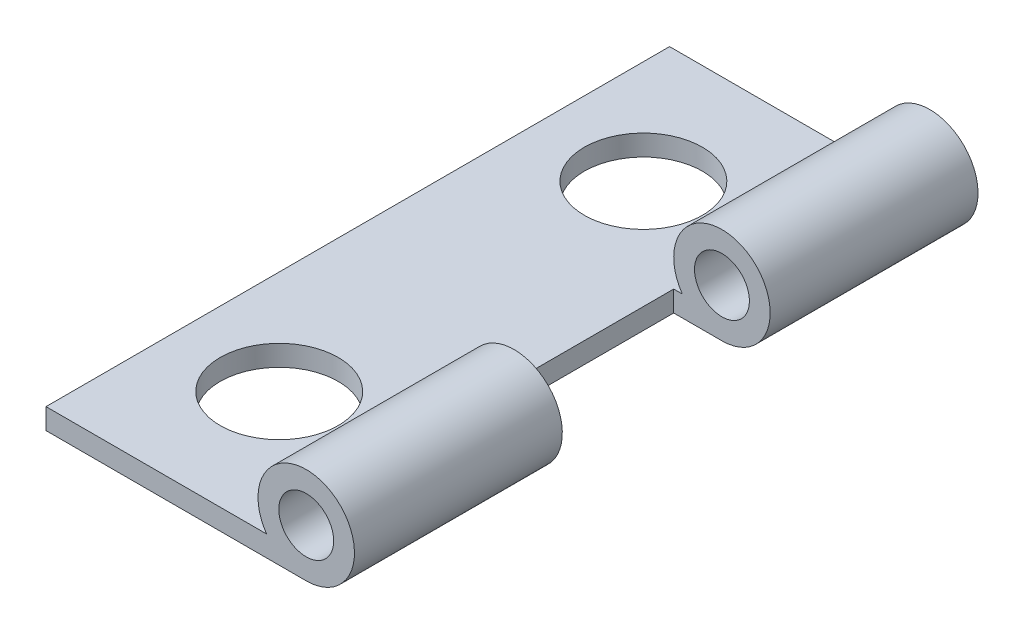
ISO-10303-21;
HEADER;
FILE_DESCRIPTION(('STEP AP214'),'2;1');
FILE_NAME('part.step','',(''),(''),'','','');
FILE_SCHEMA(('AUTOMOTIVE_DESIGN { 1 0 10303 214 1 1 1 1 }'));
ENDSEC;
DATA;
#1=APPLICATION_CONTEXT('core data for automotive mechanical design processes');
#2=APPLICATION_PROTOCOL_DEFINITION('international standard','automotive_design',2000,#1);
#3=PRODUCT_CONTEXT('',#1,'mechanical');
#4=PRODUCT('Part','Part','',(#3));
#5=PRODUCT_RELATED_PRODUCT_CATEGORY('part','',(#4));
#6=PRODUCT_DEFINITION_FORMATION('','',#4);
#7=PRODUCT_DEFINITION_CONTEXT('part definition',#1,'design');
#8=PRODUCT_DEFINITION('design','',#6,#7);
#9=PRODUCT_DEFINITION_SHAPE('','',#8);
#10=(LENGTH_UNIT() NAMED_UNIT(*) SI_UNIT(.MILLI.,.METRE.));
#11=(NAMED_UNIT(*) PLANE_ANGLE_UNIT() SI_UNIT($,.RADIAN.));
#12=(NAMED_UNIT(*) SI_UNIT($,.STERADIAN.) SOLID_ANGLE_UNIT());
#13=UNCERTAINTY_MEASURE_WITH_UNIT(LENGTH_MEASURE(1.E-05),#10,'distance_accuracy_value','');
#14=(GEOMETRIC_REPRESENTATION_CONTEXT(3) GLOBAL_UNCERTAINTY_ASSIGNED_CONTEXT((#13)) GLOBAL_UNIT_ASSIGNED_CONTEXT((#10,
#11,#12)) REPRESENTATION_CONTEXT('',''));
#15=CARTESIAN_POINT('',(0.,0.,0.));
#16=DIRECTION('',(0.,0.,1.));
#17=DIRECTION('',(1.,0.,0.));
#18=AXIS2_PLACEMENT_3D('',#15,#16,#17);
#19=CARTESIAN_POINT('',(-3.0846776,3.10992480641689,19.05));
#20=DIRECTION('',(0.,0.,-1.));
#21=DIRECTION('',(-1.,0.,0.));
#22=AXIS2_PLACEMENT_3D('',#19,#20,#21);
#23=CYLINDRICAL_SURFACE('',#22,1.4732);
#24=DIRECTION('',(0.,0.,-1.));
#25=VECTOR('',#24,1.);
#26=CARTESIAN_POINT('',(-4.29618038579952,2.27172480641689,19.05));
#27=LINE('',#26,#25);
#28=CARTESIAN_POINT('',(-4.29618038579952,2.27172480641689,6.35));
#29=VERTEX_POINT('',#28);
#30=CARTESIAN_POINT('',(-4.29618038579952,2.27172480641689,0.));
#31=VERTEX_POINT('',#30);
#32=EDGE_CURVE('E181',#29,#31,#27,.T.);
#33=ORIENTED_EDGE('',*,*,#32,.F.);
#34=CARTESIAN_POINT('',(-3.0846776,3.10992480641689,6.35));
#35=DIRECTION('',(0.,0.,-1.));
#36=DIRECTION('',(-1.,0.,0.));
#37=AXIS2_PLACEMENT_3D('',#34,#35,#36);
#38=CIRCLE('',#37,1.4732);
#39=CARTESIAN_POINT('',(-3.0846776,1.63672480641689,6.35));
#40=VERTEX_POINT('',#39);
#41=EDGE_CURVE('E142',#29,#40,#38,.T.);
#42=ORIENTED_EDGE('',*,*,#41,.T.);
#43=DIRECTION('',(0.,0.,-1.));
#44=VECTOR('',#43,1.);
#45=CARTESIAN_POINT('',(-3.0846776,1.63672480641689,19.05));
#46=LINE('',#45,#44);
#47=CARTESIAN_POINT('',(-3.0846776,1.63672480641689,0.));
#48=VERTEX_POINT('',#47);
#49=EDGE_CURVE('E185',#40,#48,#46,.T.);
#50=ORIENTED_EDGE('',*,*,#49,.T.);
#51=CARTESIAN_POINT('',(-3.0846776,3.10992480641689,0.));
#52=DIRECTION('',(0.,0.,1.));
#53=DIRECTION('',(1.,0.,0.));
#54=AXIS2_PLACEMENT_3D('',#51,#52,#53);
#55=CIRCLE('',#54,1.4732);
#56=EDGE_CURVE('E172',#48,#31,#55,.T.);
#57=ORIENTED_EDGE('',*,*,#56,.T.);
#58=EDGE_LOOP('',(#33,#42,#50,#57));
#59=FACE_BOUND('',#58,.T.);
#60=ADVANCED_FACE('F37',(#59),#23,.T.);
#61=CARTESIAN_POINT('',(-3.0846776,3.10992480641689,19.05));
#62=DIRECTION('',(0.,0.,-1.));
#63=DIRECTION('',(-1.,0.,0.));
#64=AXIS2_PLACEMENT_3D('',#61,#62,#63);
#65=CYLINDRICAL_SURFACE('',#64,0.8382);
#66=CARTESIAN_POINT('',(-3.0846776,3.10992480641689,6.35));
#67=DIRECTION('',(0.,0.,-1.));
#68=DIRECTION('',(-1.,0.,0.));
#69=AXIS2_PLACEMENT_3D('',#66,#67,#68);
#70=CIRCLE('',#69,0.8382);
#71=CARTESIAN_POINT('',(-3.9228776,3.10992480641689,6.35));
#72=VERTEX_POINT('',#71);
#73=EDGE_CURVE('E138',#72,#72,#70,.T.);
#74=ORIENTED_EDGE('',*,*,#73,.F.);
#75=EDGE_LOOP('',(#74));
#76=FACE_BOUND('',#75,.T.);
#77=CARTESIAN_POINT('',(-3.0846776,3.10992480641689,0.));
#78=DIRECTION('',(0.,0.,1.));
#79=DIRECTION('',(-1.,0.,0.));
#80=AXIS2_PLACEMENT_3D('',#77,#78,#79);
#81=CIRCLE('',#80,0.8382);
#82=CARTESIAN_POINT('',(-3.9228776,3.10992480641689,0.));
#83=VERTEX_POINT('',#82);
#84=EDGE_CURVE('E156',#83,#83,#81,.T.);
#85=ORIENTED_EDGE('',*,*,#84,.F.);
#86=EDGE_LOOP('',(#85));
#87=FACE_BOUND('',#86,.T.);
#88=ADVANCED_FACE('F194',(#76,#87),#65,.F.);
#89=CARTESIAN_POINT('',(-3.0846776,3.10992480641689,19.05));
#90=DIRECTION('',(0.,0.,1.));
#91=DIRECTION('',(1.,0.,0.));
#92=AXIS2_PLACEMENT_3D('',#89,#90,#91);
#93=PLANE('',#92);
#94=DIRECTION('',(1.,0.,0.));
#95=VECTOR('',#94,1.);
#96=CARTESIAN_POINT('',(-11.0348776,1.63672480641689,19.05));
#97=LINE('',#96,#95);
#98=CARTESIAN_POINT('',(-11.0348776,1.63672480641689,19.05));
#99=VERTEX_POINT('',#98);
#100=CARTESIAN_POINT('',(-3.0846776,1.63672480641689,19.05));
#101=VERTEX_POINT('',#100);
#102=EDGE_CURVE('E163',#99,#101,#97,.T.);
#103=ORIENTED_EDGE('',*,*,#102,.T.);
#104=CARTESIAN_POINT('',(-3.0846776,3.10992480641689,19.05));
#105=DIRECTION('',(0.,0.,1.));
#106=DIRECTION('',(1.,0.,0.));
#107=AXIS2_PLACEMENT_3D('',#104,#105,#106);
#108=CIRCLE('',#107,1.4732);
#109=CARTESIAN_POINT('',(-4.29618038579952,2.27172480641689,19.05));
#110=VERTEX_POINT('',#109);
#111=EDGE_CURVE('E90',#101,#110,#108,.T.);
#112=ORIENTED_EDGE('',*,*,#111,.T.);
#113=DIRECTION('',(-1.,0.,0.));
#114=VECTOR('',#113,1.);
#115=CARTESIAN_POINT('',(-11.0348776,2.27172480641689,19.05));
#116=LINE('',#115,#114);
#117=CARTESIAN_POINT('',(-11.0348776,2.27172480641689,19.05));
#118=VERTEX_POINT('',#117);
#119=EDGE_CURVE('E166',#110,#118,#116,.T.);
#120=ORIENTED_EDGE('',*,*,#119,.T.);
#121=DIRECTION('',(0.,-1.,0.));
#122=VECTOR('',#121,1.);
#123=CARTESIAN_POINT('',(-11.0348776,1.63672480641689,19.05));
#124=LINE('',#123,#122);
#125=EDGE_CURVE('E61',#118,#99,#124,.T.);
#126=ORIENTED_EDGE('',*,*,#125,.T.);
#127=EDGE_LOOP('',(#103,#112,#120,#126));
#128=FACE_BOUND('',#127,.T.);
#129=CARTESIAN_POINT('',(-3.0846776,3.10992480641689,19.05));
#130=DIRECTION('',(0.,0.,1.));
#131=DIRECTION('',(-1.,0.,0.));
#132=AXIS2_PLACEMENT_3D('',#129,#130,#131);
#133=CIRCLE('',#132,0.8382);
#134=CARTESIAN_POINT('',(-3.9228776,3.10992480641689,19.05));
#135=VERTEX_POINT('',#134);
#136=EDGE_CURVE('E157',#135,#135,#133,.T.);
#137=ORIENTED_EDGE('',*,*,#136,.F.);
#138=EDGE_LOOP('',(#137));
#139=FACE_BOUND('',#138,.T.);
#140=ADVANCED_FACE('F197',(#128,#139),#93,.T.);
#141=CARTESIAN_POINT('',(-3.0846776,3.10992480641689,0.));
#142=DIRECTION('',(0.,0.,1.));
#143=DIRECTION('',(1.,0.,0.));
#144=AXIS2_PLACEMENT_3D('',#141,#142,#143);
#145=PLANE('',#144);
#146=DIRECTION('',(1.,0.,0.));
#147=VECTOR('',#146,1.);
#148=CARTESIAN_POINT('',(-11.0348776,1.63672480641689,0.));
#149=LINE('',#148,#147);
#150=CARTESIAN_POINT('',(-11.0348776,1.63672480641689,0.));
#151=VERTEX_POINT('',#150);
#152=EDGE_CURVE('E160',#151,#48,#149,.T.);
#153=ORIENTED_EDGE('',*,*,#152,.F.);
#154=DIRECTION('',(0.,-1.,0.));
#155=VECTOR('',#154,1.);
#156=CARTESIAN_POINT('',(-11.0348776,1.63672480641689,0.));
#157=LINE('',#156,#155);
#158=CARTESIAN_POINT('',(-11.0348776,2.27172480641689,0.));
#159=VERTEX_POINT('',#158);
#160=EDGE_CURVE('E82',#159,#151,#157,.T.);
#161=ORIENTED_EDGE('',*,*,#160,.F.);
#162=DIRECTION('',(-1.,0.,0.));
#163=VECTOR('',#162,1.);
#164=CARTESIAN_POINT('',(-11.0348776,2.27172480641689,0.));
#165=LINE('',#164,#163);
#166=EDGE_CURVE('E175',#31,#159,#165,.T.);
#167=ORIENTED_EDGE('',*,*,#166,.F.);
#168=ORIENTED_EDGE('',*,*,#56,.F.);
#169=EDGE_LOOP('',(#153,#161,#167,#168));
#170=FACE_BOUND('',#169,.T.);
#171=ORIENTED_EDGE('',*,*,#84,.T.);
#172=EDGE_LOOP('',(#171));
#173=FACE_BOUND('',#172,.T.);
#174=ADVANCED_FACE('F202',(#170,#173),#145,.F.);
#175=CARTESIAN_POINT('',(-11.0348776,1.63672480641689,19.05));
#176=DIRECTION('',(0.,1.,0.));
#177=DIRECTION('',(0.,0.,1.));
#178=AXIS2_PLACEMENT_3D('',#175,#176,#177);
#179=PLANE('',#178);
#180=CARTESIAN_POINT('',(-7.87247837519343,1.63672480641689,3.9624));
#181=DIRECTION('',(0.,1.,0.));
#182=DIRECTION('',(0.,0.,1.));
#183=AXIS2_PLACEMENT_3D('',#180,#181,#182);
#184=CIRCLE('',#183,1.80340000000001);
#185=CARTESIAN_POINT('',(-7.87247837519343,1.63672480641689,5.76580000000001));
#186=VERTEX_POINT('',#185);
#187=EDGE_CURVE('E153',#186,#186,#184,.T.);
#188=ORIENTED_EDGE('',*,*,#187,.T.);
#189=EDGE_LOOP('',(#188));
#190=FACE_BOUND('',#189,.T.);
#191=CARTESIAN_POINT('',(-7.87247837519343,1.63672480641689,15.0876));
#192=DIRECTION('',(0.,1.,0.));
#193=DIRECTION('',(0.,0.,1.));
#194=AXIS2_PLACEMENT_3D('',#191,#192,#193);
#195=CIRCLE('',#194,1.8034);
#196=CARTESIAN_POINT('',(-7.87247837519343,1.63672480641689,16.891));
#197=VERTEX_POINT('',#196);
#198=EDGE_CURVE('E148',#197,#197,#195,.T.);
#199=ORIENTED_EDGE('',*,*,#198,.T.);
#200=EDGE_LOOP('',(#199));
#201=FACE_BOUND('',#200,.T.);
#202=ORIENTED_EDGE('',*,*,#49,.F.);
#203=DIRECTION('',(-1.,0.,0.));
#204=VECTOR('',#203,1.);
#205=CARTESIAN_POINT('',(-4.5578776,1.63672480641689,6.35));
#206=LINE('',#205,#204);
#207=CARTESIAN_POINT('',(-4.5578776,1.63672480641689,6.35));
#208=VERTEX_POINT('',#207);
#209=EDGE_CURVE('E119',#40,#208,#206,.T.);
#210=ORIENTED_EDGE('',*,*,#209,.T.);
#211=DIRECTION('',(0.,0.,1.));
#212=VECTOR('',#211,1.);
#213=CARTESIAN_POINT('',(-4.5578776,1.63672480641689,6.35));
#214=LINE('',#213,#212);
#215=CARTESIAN_POINT('',(-4.5578776,1.63672480641689,12.7));
#216=VERTEX_POINT('',#215);
#217=EDGE_CURVE('E115',#208,#216,#214,.T.);
#218=ORIENTED_EDGE('',*,*,#217,.T.);
#219=DIRECTION('',(1.,0.,0.));
#220=VECTOR('',#219,1.);
#221=CARTESIAN_POINT('',(-4.5578776,1.63672480641689,12.7));
#222=LINE('',#221,#220);
#223=CARTESIAN_POINT('',(-3.0846776,1.63672480641689,12.7));
#224=VERTEX_POINT('',#223);
#225=EDGE_CURVE('E122',#216,#224,#222,.T.);
#226=ORIENTED_EDGE('',*,*,#225,.T.);
#227=EDGE_CURVE('E45',#101,#224,#46,.T.);
#228=ORIENTED_EDGE('',*,*,#227,.F.);
#229=ORIENTED_EDGE('',*,*,#102,.F.);
#230=DIRECTION('',(0.,0.,-1.));
#231=VECTOR('',#230,1.);
#232=CARTESIAN_POINT('',(-11.0348776,1.63672480641689,19.05));
#233=LINE('',#232,#231);
#234=EDGE_CURVE('E169',#99,#151,#233,.T.);
#235=ORIENTED_EDGE('',*,*,#234,.T.);
#236=ORIENTED_EDGE('',*,*,#152,.T.);
#237=EDGE_LOOP('',(#202,#210,#218,#226,#228,#229,#235,#236));
#238=FACE_BOUND('',#237,.T.);
#239=ADVANCED_FACE('F39',(#190,#201,#238),#179,.F.);
#240=CARTESIAN_POINT('',(-3.0846776,3.10992480641689,12.7));
#241=DIRECTION('',(0.,0.,1.));
#242=DIRECTION('',(1.,0.,0.));
#243=AXIS2_PLACEMENT_3D('',#240,#241,#242);
#244=CIRCLE('',#243,1.4732);
#245=CARTESIAN_POINT('',(-4.29618038579952,2.27172480641689,12.7));
#246=VERTEX_POINT('',#245);
#247=EDGE_CURVE('E124',#224,#246,#244,.T.);
#248=ORIENTED_EDGE('',*,*,#247,.T.);
#249=EDGE_CURVE('E182',#110,#246,#27,.T.);
#250=ORIENTED_EDGE('',*,*,#249,.F.);
#251=ORIENTED_EDGE('',*,*,#111,.F.);
#252=ORIENTED_EDGE('',*,*,#227,.T.);
#253=EDGE_LOOP('',(#248,#250,#251,#252));
#254=FACE_BOUND('',#253,.T.);
#255=ADVANCED_FACE('F210',(#254),#23,.T.);
#256=CARTESIAN_POINT('',(-11.0348776,2.27172480641689,19.05));
#257=DIRECTION('',(0.,-1.,0.));
#258=DIRECTION('',(1.,0.,0.));
#259=AXIS2_PLACEMENT_3D('',#256,#257,#258);
#260=PLANE('',#259);
#261=CARTESIAN_POINT('',(-7.87247837519343,2.27172480641688,3.9624));
#262=DIRECTION('',(0.,1.,0.));
#263=DIRECTION('',(-1.,0.,0.));
#264=AXIS2_PLACEMENT_3D('',#261,#262,#263);
#265=CIRCLE('',#264,1.80340000000001);
#266=CARTESIAN_POINT('',(-9.67587837519344,2.27172480641688,3.9624));
#267=VERTEX_POINT('',#266);
#268=EDGE_CURVE('E145',#267,#267,#265,.T.);
#269=ORIENTED_EDGE('',*,*,#268,.F.);
#270=EDGE_LOOP('',(#269));
#271=FACE_BOUND('',#270,.T.);
#272=CARTESIAN_POINT('',(-7.87247837519343,2.27172480641688,15.0876));
#273=DIRECTION('',(0.,1.,0.));
#274=DIRECTION('',(-1.,0.,0.));
#275=AXIS2_PLACEMENT_3D('',#272,#273,#274);
#276=CIRCLE('',#275,1.8034);
#277=CARTESIAN_POINT('',(-9.67587837519343,2.27172480641688,15.0876));
#278=VERTEX_POINT('',#277);
#279=EDGE_CURVE('E144',#278,#278,#276,.T.);
#280=ORIENTED_EDGE('',*,*,#279,.F.);
#281=EDGE_LOOP('',(#280));
#282=FACE_BOUND('',#281,.T.);
#283=DIRECTION('',(0.,0.,-1.));
#284=VECTOR('',#283,1.);
#285=CARTESIAN_POINT('',(-4.5578776,2.27172480641689,19.05));
#286=LINE('',#285,#284);
#287=CARTESIAN_POINT('',(-4.5578776,2.27172480641689,12.7));
#288=VERTEX_POINT('',#287);
#289=CARTESIAN_POINT('',(-4.5578776,2.27172480641689,6.35));
#290=VERTEX_POINT('',#289);
#291=EDGE_CURVE('E11',#288,#290,#286,.T.);
#292=ORIENTED_EDGE('',*,*,#291,.T.);
#293=DIRECTION('',(1.,0.,0.));
#294=VECTOR('',#293,1.);
#295=CARTESIAN_POINT('',(-11.0348776,2.27172480641689,6.35));
#296=LINE('',#295,#294);
#297=EDGE_CURVE('E139',#290,#29,#296,.T.);
#298=ORIENTED_EDGE('',*,*,#297,.T.);
#299=ORIENTED_EDGE('',*,*,#32,.T.);
#300=ORIENTED_EDGE('',*,*,#166,.T.);
#301=DIRECTION('',(0.,0.,-1.));
#302=VECTOR('',#301,1.);
#303=CARTESIAN_POINT('',(-11.0348776,2.27172480641689,19.05));
#304=LINE('',#303,#302);
#305=EDGE_CURVE('E179',#118,#159,#304,.T.);
#306=ORIENTED_EDGE('',*,*,#305,.F.);
#307=ORIENTED_EDGE('',*,*,#119,.F.);
#308=ORIENTED_EDGE('',*,*,#249,.T.);
#309=DIRECTION('',(-1.,0.,0.));
#310=VECTOR('',#309,1.);
#311=CARTESIAN_POINT('',(-11.0348776,2.27172480641689,12.7));
#312=LINE('',#311,#310);
#313=EDGE_CURVE('E135',#246,#288,#312,.T.);
#314=ORIENTED_EDGE('',*,*,#313,.T.);
#315=EDGE_LOOP('',(#292,#298,#299,#300,#306,#307,#308,#314));
#316=FACE_BOUND('',#315,.T.);
#317=ADVANCED_FACE('F222',(#271,#282,#316),#260,.F.);
#318=CARTESIAN_POINT('',(-11.0348776,1.63672480641689,19.05));
#319=DIRECTION('',(1.,0.,0.));
#320=DIRECTION('',(0.,0.,-1.));
#321=AXIS2_PLACEMENT_3D('',#318,#319,#320);
#322=PLANE('',#321);
#323=ORIENTED_EDGE('',*,*,#160,.T.);
#324=ORIENTED_EDGE('',*,*,#234,.F.);
#325=ORIENTED_EDGE('',*,*,#125,.F.);
#326=ORIENTED_EDGE('',*,*,#305,.T.);
#327=EDGE_LOOP('',(#323,#324,#325,#326));
#328=FACE_BOUND('',#327,.T.);
#329=ADVANCED_FACE('F226',(#328),#322,.F.);
#330=CARTESIAN_POINT('',(-3.0846776,3.10992480641689,12.7));
#331=DIRECTION('',(0.,0.,1.));
#332=DIRECTION('',(1.,0.,0.));
#333=AXIS2_PLACEMENT_3D('',#330,#331,#332);
#334=CIRCLE('',#333,0.8382);
#335=CARTESIAN_POINT('',(-2.2464776,3.10992480641689,12.7));
#336=VERTEX_POINT('',#335);
#337=EDGE_CURVE('E133',#336,#336,#334,.T.);
#338=ORIENTED_EDGE('',*,*,#337,.F.);
#339=EDGE_LOOP('',(#338));
#340=FACE_BOUND('',#339,.T.);
#341=ORIENTED_EDGE('',*,*,#136,.T.);
#342=EDGE_LOOP('',(#341));
#343=FACE_BOUND('',#342,.T.);
#344=ADVANCED_FACE('F199',(#340,#343),#65,.F.);
#345=CARTESIAN_POINT('',(-7.87247837519343,-0.268275193583115,15.0876));
#346=DIRECTION('',(0.,1.,0.));
#347=DIRECTION('',(-1.,0.,0.));
#348=AXIS2_PLACEMENT_3D('',#345,#346,#347);
#349=CYLINDRICAL_SURFACE('',#348,1.8034);
#350=ORIENTED_EDGE('',*,*,#279,.T.);
#351=EDGE_LOOP('',(#350));
#352=FACE_BOUND('',#351,.T.);
#353=ORIENTED_EDGE('',*,*,#198,.F.);
#354=EDGE_LOOP('',(#353));
#355=FACE_BOUND('',#354,.T.);
#356=ADVANCED_FACE('F239',(#352,#355),#349,.F.);
#357=CARTESIAN_POINT('',(-7.87247837519343,-0.268275193583115,3.9624));
#358=DIRECTION('',(0.,1.,0.));
#359=DIRECTION('',(-1.,0.,0.));
#360=AXIS2_PLACEMENT_3D('',#357,#358,#359);
#361=CYLINDRICAL_SURFACE('',#360,1.80340000000001);
#362=ORIENTED_EDGE('',*,*,#268,.T.);
#363=EDGE_LOOP('',(#362));
#364=FACE_BOUND('',#363,.T.);
#365=ORIENTED_EDGE('',*,*,#187,.F.);
#366=EDGE_LOOP('',(#365));
#367=FACE_BOUND('',#366,.T.);
#368=ADVANCED_FACE('F244',(#364,#367),#361,.F.);
#369=CARTESIAN_POINT('',(-4.5578776,1.63672480641689,6.35));
#370=DIRECTION('',(-1.,0.,0.));
#371=DIRECTION('',(0.,0.,1.));
#372=AXIS2_PLACEMENT_3D('',#369,#370,#371);
#373=PLANE('',#372);
#374=DIRECTION('',(0.,1.,0.));
#375=VECTOR('',#374,1.);
#376=CARTESIAN_POINT('',(-4.5578776,1.63672480641689,12.7));
#377=LINE('',#376,#375);
#378=EDGE_CURVE('E52',#216,#288,#377,.T.);
#379=ORIENTED_EDGE('',*,*,#378,.F.);
#380=ORIENTED_EDGE('',*,*,#217,.F.);
#381=DIRECTION('',(0.,1.,0.));
#382=VECTOR('',#381,1.);
#383=CARTESIAN_POINT('',(-4.5578776,1.63672480641689,6.35));
#384=LINE('',#383,#382);
#385=EDGE_CURVE('E118',#208,#290,#384,.T.);
#386=ORIENTED_EDGE('',*,*,#385,.T.);
#387=ORIENTED_EDGE('',*,*,#291,.F.);
#388=EDGE_LOOP('',(#379,#380,#386,#387));
#389=FACE_BOUND('',#388,.T.);
#390=ADVANCED_FACE('F112',(#389),#373,.F.);
#391=CARTESIAN_POINT('',(-4.5578776,1.63672480641689,6.35));
#392=DIRECTION('',(0.,0.,-1.));
#393=DIRECTION('',(-1.,0.,0.));
#394=AXIS2_PLACEMENT_3D('',#391,#392,#393);
#395=PLANE('',#394);
#396=ORIENTED_EDGE('',*,*,#73,.T.);
#397=EDGE_LOOP('',(#396));
#398=FACE_BOUND('',#397,.T.);
#399=ORIENTED_EDGE('',*,*,#41,.F.);
#400=ORIENTED_EDGE('',*,*,#297,.F.);
#401=ORIENTED_EDGE('',*,*,#385,.F.);
#402=ORIENTED_EDGE('',*,*,#209,.F.);
#403=EDGE_LOOP('',(#399,#400,#401,#402));
#404=FACE_BOUND('',#403,.T.);
#405=ADVANCED_FACE('F191',(#398,#404),#395,.F.);
#406=CARTESIAN_POINT('',(-4.5578776,1.63672480641689,12.7));
#407=DIRECTION('',(0.,0.,1.));
#408=DIRECTION('',(1.,0.,0.));
#409=AXIS2_PLACEMENT_3D('',#406,#407,#408);
#410=PLANE('',#409);
#411=ORIENTED_EDGE('',*,*,#337,.T.);
#412=EDGE_LOOP('',(#411));
#413=FACE_BOUND('',#412,.T.);
#414=ORIENTED_EDGE('',*,*,#225,.F.);
#415=ORIENTED_EDGE('',*,*,#378,.T.);
#416=ORIENTED_EDGE('',*,*,#313,.F.);
#417=ORIENTED_EDGE('',*,*,#247,.F.);
#418=EDGE_LOOP('',(#414,#415,#416,#417));
#419=FACE_BOUND('',#418,.T.);
#420=ADVANCED_FACE('F123',(#413,#419),#410,.F.);
#421=CLOSED_SHELL('',(#60,#88,#140,#174,#239,#255,#317,#329,#344,#356,#368,#390,#405,#420));
#422=MANIFOLD_SOLID_BREP('B2',#421);
#423=ADVANCED_BREP_SHAPE_REPRESENTATION('',(#18,#422),#14);
#424=SHAPE_DEFINITION_REPRESENTATION(#9,#423);
ENDSEC;
END-ISO-10303-21;
